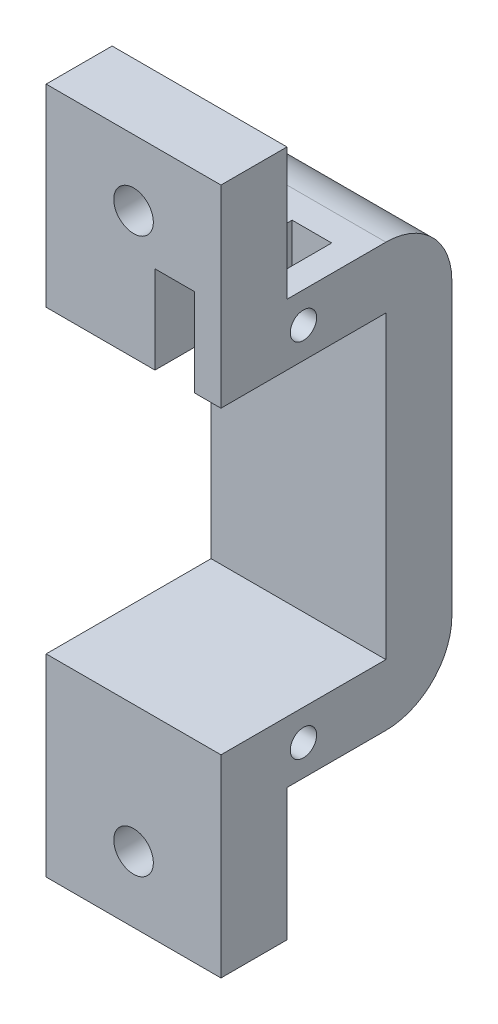
ISO-10303-21;
HEADER;
FILE_DESCRIPTION(('STEP AP214'),'2;1');
FILE_NAME('part.step','',(''),(''),'','','');
FILE_SCHEMA(('AUTOMOTIVE_DESIGN { 1 0 10303 214 1 1 1 1 }'));
ENDSEC;
DATA;
#1=APPLICATION_CONTEXT('core data for automotive mechanical design processes');
#2=APPLICATION_PROTOCOL_DEFINITION('international standard','automotive_design',2000,#1);
#3=PRODUCT_CONTEXT('',#1,'mechanical');
#4=PRODUCT('Part','Part','',(#3));
#5=PRODUCT_RELATED_PRODUCT_CATEGORY('part','',(#4));
#6=PRODUCT_DEFINITION_FORMATION('','',#4);
#7=PRODUCT_DEFINITION_CONTEXT('part definition',#1,'design');
#8=PRODUCT_DEFINITION('design','',#6,#7);
#9=PRODUCT_DEFINITION_SHAPE('','',#8);
#10=(LENGTH_UNIT() NAMED_UNIT(*) SI_UNIT(.MILLI.,.METRE.));
#11=(NAMED_UNIT(*) PLANE_ANGLE_UNIT() SI_UNIT($,.RADIAN.));
#12=(NAMED_UNIT(*) SI_UNIT($,.STERADIAN.) SOLID_ANGLE_UNIT());
#13=UNCERTAINTY_MEASURE_WITH_UNIT(LENGTH_MEASURE(1.E-05),#10,'distance_accuracy_value','');
#14=(GEOMETRIC_REPRESENTATION_CONTEXT(3) GLOBAL_UNCERTAINTY_ASSIGNED_CONTEXT((#13)) GLOBAL_UNIT_ASSIGNED_CONTEXT((#10,
#11,#12)) REPRESENTATION_CONTEXT('',''));
#15=CARTESIAN_POINT('',(0.,0.,0.));
#16=DIRECTION('',(0.,0.,1.));
#17=DIRECTION('',(1.,0.,0.));
#18=AXIS2_PLACEMENT_3D('',#15,#16,#17);
#19=CARTESIAN_POINT('',(-21.7379181981433,-2.325,12.411797698406));
#20=DIRECTION('',(1.,0.,0.));
#21=DIRECTION('',(0.,0.,-1.));
#22=AXIS2_PLACEMENT_3D('',#19,#20,#21);
#23=CYLINDRICAL_SURFACE('',#22,1.);
#24=CARTESIAN_POINT('',(-13.4879181981433,-2.325,12.411797698406));
#25=DIRECTION('',(-1.,0.,0.));
#26=DIRECTION('',(0.,0.,1.));
#27=AXIS2_PLACEMENT_3D('',#24,#25,#26);
#28=CIRCLE('',#27,1.);
#29=CARTESIAN_POINT('',(-13.4879181981433,-2.325,13.411797698406));
#30=VERTEX_POINT('',#29);
#31=EDGE_CURVE('E288',#30,#30,#28,.F.);
#32=ORIENTED_EDGE('',*,*,#31,.T.);
#33=EDGE_LOOP('',(#32));
#34=FACE_BOUND('',#33,.T.);
#35=CARTESIAN_POINT('',(-21.7379181981433,-2.325,12.411797698406));
#36=DIRECTION('',(1.,0.,0.));
#37=DIRECTION('',(0.,0.,-1.));
#38=AXIS2_PLACEMENT_3D('',#35,#36,#37);
#39=CIRCLE('',#38,1.);
#40=CARTESIAN_POINT('',(-21.7379181981433,-2.325,11.411797698406));
#41=VERTEX_POINT('',#40);
#42=EDGE_CURVE('E356',#41,#41,#39,.T.);
#43=ORIENTED_EDGE('',*,*,#42,.F.);
#44=EDGE_LOOP('',(#43));
#45=FACE_BOUND('',#44,.T.);
#46=ADVANCED_FACE('F34',(#34,#45),#23,.F.);
#47=CARTESIAN_POINT('',(-21.7379181981433,-32.05,1.16179769840603));
#48=DIRECTION('',(0.,1.,0.));
#49=DIRECTION('',(-1.,0.,0.));
#50=AXIS2_PLACEMENT_3D('',#47,#48,#49);
#51=PLANE('',#50);
#52=DIRECTION('',(0.,0.,1.));
#53=VECTOR('',#52,1.);
#54=CARTESIAN_POINT('',(-21.7379181981433,-32.05,1.16179769840603));
#55=LINE('',#54,#53);
#56=CARTESIAN_POINT('',(-21.7379181981433,-32.05,6.16179769840603));
#57=VERTEX_POINT('',#56);
#58=CARTESIAN_POINT('',(-21.7379181981433,-32.05,13.661797698406));
#59=VERTEX_POINT('',#58);
#60=EDGE_CURVE('E257',#57,#59,#55,.T.);
#61=ORIENTED_EDGE('',*,*,#60,.F.);
#62=DIRECTION('',(-1.,0.,0.));
#63=VECTOR('',#62,1.);
#64=CARTESIAN_POINT('',(-21.7379181981433,-32.05,6.16179769840603));
#65=LINE('',#64,#63);
#66=CARTESIAN_POINT('',(-8.48791819814331,-32.05,6.16179769840603));
#67=VERTEX_POINT('',#66);
#68=EDGE_CURVE('E42',#57,#67,#65,.F.);
#69=ORIENTED_EDGE('',*,*,#68,.T.);
#70=DIRECTION('',(0.,0.,1.));
#71=VECTOR('',#70,1.);
#72=CARTESIAN_POINT('',(-8.48791819814331,-32.05,1.16179769840603));
#73=LINE('',#72,#71);
#74=CARTESIAN_POINT('',(-8.48791819814331,-32.05,13.661797698406));
#75=VERTEX_POINT('',#74);
#76=EDGE_CURVE('E262',#67,#75,#73,.T.);
#77=ORIENTED_EDGE('',*,*,#76,.T.);
#78=DIRECTION('',(1.,0.,0.));
#79=VECTOR('',#78,1.);
#80=CARTESIAN_POINT('',(-21.7379181981433,-32.05,13.661797698406));
#81=LINE('',#80,#79);
#82=EDGE_CURVE('E216',#59,#75,#81,.T.);
#83=ORIENTED_EDGE('',*,*,#82,.F.);
#84=EDGE_LOOP('',(#61,#69,#77,#83));
#85=FACE_BOUND('',#84,.T.);
#86=ADVANCED_FACE('F325',(#85),#51,.F.);
#87=CARTESIAN_POINT('',(0.,0.,6.16179769840603));
#88=DIRECTION('',(0.,0.,1.));
#89=DIRECTION('',(1.,0.,0.));
#90=AXIS2_PLACEMENT_3D('',#87,#88,#89);
#91=PLANE('',#90);
#92=DIRECTION('',(0.,1.,0.));
#93=VECTOR('',#92,1.);
#94=CARTESIAN_POINT('',(-21.7379181981433,0.,6.16179769840603));
#95=LINE('',#94,#93);
#96=CARTESIAN_POINT('',(-21.7379181981433,-27.4,6.16179769840603));
#97=VERTEX_POINT('',#96);
#98=CARTESIAN_POINT('',(-21.7379181981433,-4.65,6.16179769840603));
#99=VERTEX_POINT('',#98);
#100=EDGE_CURVE('E250',#97,#99,#95,.T.);
#101=ORIENTED_EDGE('',*,*,#100,.F.);
#102=DIRECTION('',(-1.,0.,0.));
#103=VECTOR('',#102,1.);
#104=CARTESIAN_POINT('',(-8.48791819814331,-27.4,6.16179769840603));
#105=LINE('',#104,#103);
#106=CARTESIAN_POINT('',(-8.48791819814331,-27.4,6.16179769840603));
#107=VERTEX_POINT('',#106);
#108=EDGE_CURVE('E236',#107,#97,#105,.T.);
#109=ORIENTED_EDGE('',*,*,#108,.F.);
#110=DIRECTION('',(0.,-1.,0.));
#111=VECTOR('',#110,1.);
#112=CARTESIAN_POINT('',(-8.4879181981433,0.,6.16179769840603));
#113=LINE('',#112,#111);
#114=CARTESIAN_POINT('',(-8.4879181981433,-4.65,6.16179769840603));
#115=VERTEX_POINT('',#114);
#116=EDGE_CURVE('E254',#115,#107,#113,.T.);
#117=ORIENTED_EDGE('',*,*,#116,.F.);
#118=DIRECTION('',(-1.,0.,0.));
#119=VECTOR('',#118,1.);
#120=CARTESIAN_POINT('',(-21.7379181981433,-4.65,6.16179769840603));
#121=LINE('',#120,#119);
#122=EDGE_CURVE('E274',#115,#99,#121,.T.);
#123=ORIENTED_EDGE('',*,*,#122,.T.);
#124=EDGE_LOOP('',(#101,#109,#117,#123));
#125=FACE_BOUND('',#124,.T.);
#126=ADVANCED_FACE('F333',(#125),#91,.T.);
#127=CARTESIAN_POINT('',(-21.7379181981433,-4.65,6.16179769840603));
#128=DIRECTION('',(-1.,0.,0.));
#129=DIRECTION('',(0.,0.,1.));
#130=AXIS2_PLACEMENT_3D('',#127,#128,#129);
#131=PLANE('',#130);
#132=CARTESIAN_POINT('',(-21.7379181981433,-29.725,12.411797698406));
#133=DIRECTION('',(1.,0.,0.));
#134=DIRECTION('',(0.,0.,-1.));
#135=AXIS2_PLACEMENT_3D('',#132,#133,#134);
#136=CIRCLE('',#135,1.);
#137=CARTESIAN_POINT('',(-21.7379181981433,-29.725,11.411797698406));
#138=VERTEX_POINT('',#137);
#139=EDGE_CURVE('E357',#138,#138,#136,.T.);
#140=ORIENTED_EDGE('',*,*,#139,.T.);
#141=EDGE_LOOP('',(#140));
#142=FACE_BOUND('',#141,.T.);
#143=ORIENTED_EDGE('',*,*,#42,.T.);
#144=EDGE_LOOP('',(#143));
#145=FACE_BOUND('',#144,.T.);
#146=DIRECTION('',(0.,1.,0.));
#147=VECTOR('',#146,1.);
#148=CARTESIAN_POINT('',(-21.7379181981433,0.,1.16179769840603));
#149=LINE('',#148,#147);
#150=CARTESIAN_POINT('',(-21.7379181981433,-27.05,1.16179769840603));
#151=VERTEX_POINT('',#150);
#152=CARTESIAN_POINT('',(-21.7379181981433,-5.,1.16179769840603));
#153=VERTEX_POINT('',#152);
#154=EDGE_CURVE('E251',#151,#153,#149,.T.);
#155=ORIENTED_EDGE('',*,*,#154,.F.);
#156=CARTESIAN_POINT('',(-21.7379181981433,-27.05,6.16179769840603));
#157=DIRECTION('',(-1.,0.,0.));
#158=DIRECTION('',(0.,0.,1.));
#159=AXIS2_PLACEMENT_3D('',#156,#157,#158);
#160=CIRCLE('',#159,5.);
#161=EDGE_CURVE('E56',#151,#57,#160,.T.);
#162=ORIENTED_EDGE('',*,*,#161,.T.);
#163=ORIENTED_EDGE('',*,*,#60,.T.);
#164=DIRECTION('',(0.,1.,0.));
#165=VECTOR('',#164,1.);
#166=CARTESIAN_POINT('',(-21.7379181981433,-42.05,13.661797698406));
#167=LINE('',#166,#165);
#168=CARTESIAN_POINT('',(-21.7379181981433,-42.05,13.661797698406));
#169=VERTEX_POINT('',#168);
#170=EDGE_CURVE('E233',#169,#59,#167,.T.);
#171=ORIENTED_EDGE('',*,*,#170,.F.);
#172=DIRECTION('',(0.,0.,-1.));
#173=VECTOR('',#172,1.);
#174=CARTESIAN_POINT('',(-21.7379181981433,-42.05,18.661797698406));
#175=LINE('',#174,#173);
#176=CARTESIAN_POINT('',(-21.7379181981433,-42.05,18.661797698406));
#177=VERTEX_POINT('',#176);
#178=EDGE_CURVE('E217',#177,#169,#175,.T.);
#179=ORIENTED_EDGE('',*,*,#178,.F.);
#180=DIRECTION('',(0.,-1.,0.));
#181=VECTOR('',#180,1.);
#182=CARTESIAN_POINT('',(-21.7379181981433,-32.05,18.661797698406));
#183=LINE('',#182,#181);
#184=CARTESIAN_POINT('',(-21.7379181981433,-27.4,18.661797698406));
#185=VERTEX_POINT('',#184);
#186=EDGE_CURVE('E242',#185,#177,#183,.T.);
#187=ORIENTED_EDGE('',*,*,#186,.F.);
#188=DIRECTION('',(0.,0.,-1.));
#189=VECTOR('',#188,1.);
#190=CARTESIAN_POINT('',(-21.7379181981433,-27.4,18.661797698406));
#191=LINE('',#190,#189);
#192=EDGE_CURVE('E244',#185,#97,#191,.T.);
#193=ORIENTED_EDGE('',*,*,#192,.T.);
#194=ORIENTED_EDGE('',*,*,#100,.T.);
#195=DIRECTION('',(0.,0.,1.));
#196=VECTOR('',#195,1.);
#197=CARTESIAN_POINT('',(-21.7379181981433,-4.65,6.16179769840603));
#198=LINE('',#197,#196);
#199=CARTESIAN_POINT('',(-21.7379181981433,-4.65,18.661797698406));
#200=VERTEX_POINT('',#199);
#201=EDGE_CURVE('E264',#99,#200,#198,.T.);
#202=ORIENTED_EDGE('',*,*,#201,.T.);
#203=DIRECTION('',(0.,1.,0.));
#204=VECTOR('',#203,1.);
#205=CARTESIAN_POINT('',(-21.7379181981433,-4.65,18.661797698406));
#206=LINE('',#205,#204);
#207=CARTESIAN_POINT('',(-21.7379181981433,10.,18.661797698406));
#208=VERTEX_POINT('',#207);
#209=EDGE_CURVE('E277',#200,#208,#206,.T.);
#210=ORIENTED_EDGE('',*,*,#209,.T.);
#211=DIRECTION('',(0.,0.,1.));
#212=VECTOR('',#211,1.);
#213=CARTESIAN_POINT('',(-21.7379181981433,10.,18.661797698406));
#214=LINE('',#213,#212);
#215=CARTESIAN_POINT('',(-21.7379181981433,10.,13.661797698406));
#216=VERTEX_POINT('',#215);
#217=EDGE_CURVE('E203',#216,#208,#214,.T.);
#218=ORIENTED_EDGE('',*,*,#217,.F.);
#219=DIRECTION('',(0.,-1.,0.));
#220=VECTOR('',#219,1.);
#221=CARTESIAN_POINT('',(-21.7379181981433,10.,13.661797698406));
#222=LINE('',#221,#220);
#223=CARTESIAN_POINT('',(-21.7379181981433,0.,13.661797698406));
#224=VERTEX_POINT('',#223);
#225=EDGE_CURVE('E211',#216,#224,#222,.T.);
#226=ORIENTED_EDGE('',*,*,#225,.T.);
#227=DIRECTION('',(0.,0.,1.));
#228=VECTOR('',#227,1.);
#229=CARTESIAN_POINT('',(-21.7379181981433,0.,6.16179769840603));
#230=LINE('',#229,#228);
#231=CARTESIAN_POINT('',(-21.7379181981433,0.,6.16179769840603));
#232=VERTEX_POINT('',#231);
#233=EDGE_CURVE('E199',#232,#224,#230,.T.);
#234=ORIENTED_EDGE('',*,*,#233,.F.);
#235=CARTESIAN_POINT('',(-21.7379181981433,-5.,6.16179769840603));
#236=DIRECTION('',(-1.,0.,0.));
#237=DIRECTION('',(0.,0.,1.));
#238=AXIS2_PLACEMENT_3D('',#235,#236,#237);
#239=CIRCLE('',#238,5.);
#240=EDGE_CURVE('E298',#232,#153,#239,.T.);
#241=ORIENTED_EDGE('',*,*,#240,.T.);
#242=EDGE_LOOP('',(#155,#162,#163,#171,#179,#187,#193,#194,#202,#210,#218,#226,#234,#241));
#243=FACE_BOUND('',#242,.T.);
#244=ADVANCED_FACE('F310',(#142,#145,#243),#131,.T.);
#245=CARTESIAN_POINT('',(-8.4879181981433,-4.65,6.16179769840603));
#246=DIRECTION('',(1.,0.,0.));
#247=DIRECTION('',(0.,0.,-1.));
#248=AXIS2_PLACEMENT_3D('',#245,#246,#247);
#249=PLANE('',#248);
#250=CARTESIAN_POINT('',(-8.4879181981433,-29.725,12.411797698406));
#251=DIRECTION('',(1.,0.,0.));
#252=DIRECTION('',(0.,0.,-1.));
#253=AXIS2_PLACEMENT_3D('',#250,#251,#252);
#254=CIRCLE('',#253,1.);
#255=CARTESIAN_POINT('',(-8.4879181981433,-29.725,11.411797698406));
#256=VERTEX_POINT('',#255);
#257=EDGE_CURVE('E363',#256,#256,#254,.T.);
#258=ORIENTED_EDGE('',*,*,#257,.F.);
#259=EDGE_LOOP('',(#258));
#260=FACE_BOUND('',#259,.T.);
#261=CARTESIAN_POINT('',(-8.4879181981433,-2.325,12.411797698406));
#262=DIRECTION('',(1.,0.,0.));
#263=DIRECTION('',(0.,0.,-1.));
#264=AXIS2_PLACEMENT_3D('',#261,#262,#263);
#265=CIRCLE('',#264,1.);
#266=CARTESIAN_POINT('',(-8.4879181981433,-2.325,11.411797698406));
#267=VERTEX_POINT('',#266);
#268=EDGE_CURVE('E354',#267,#267,#265,.T.);
#269=ORIENTED_EDGE('',*,*,#268,.F.);
#270=EDGE_LOOP('',(#269));
#271=FACE_BOUND('',#270,.T.);
#272=ORIENTED_EDGE('',*,*,#76,.F.);
#273=CARTESIAN_POINT('',(-8.4879181981433,-27.05,6.16179769840603));
#274=DIRECTION('',(1.,0.,0.));
#275=DIRECTION('',(0.,0.,-1.));
#276=AXIS2_PLACEMENT_3D('',#273,#274,#275);
#277=CIRCLE('',#276,5.);
#278=CARTESIAN_POINT('',(-8.48791819814331,-27.05,1.16179769840603));
#279=VERTEX_POINT('',#278);
#280=EDGE_CURVE('E11',#67,#279,#277,.T.);
#281=ORIENTED_EDGE('',*,*,#280,.T.);
#282=DIRECTION('',(0.,-1.,0.));
#283=VECTOR('',#282,1.);
#284=CARTESIAN_POINT('',(-8.4879181981433,0.,1.16179769840603));
#285=LINE('',#284,#283);
#286=CARTESIAN_POINT('',(-8.4879181981433,-5.,1.16179769840603));
#287=VERTEX_POINT('',#286);
#288=EDGE_CURVE('E253',#287,#279,#285,.T.);
#289=ORIENTED_EDGE('',*,*,#288,.F.);
#290=CARTESIAN_POINT('',(-8.4879181981433,-5.,6.16179769840603));
#291=DIRECTION('',(1.,0.,0.));
#292=DIRECTION('',(0.,0.,-1.));
#293=AXIS2_PLACEMENT_3D('',#290,#291,#292);
#294=CIRCLE('',#293,5.);
#295=CARTESIAN_POINT('',(-8.4879181981433,0.,6.16179769840603));
#296=VERTEX_POINT('',#295);
#297=EDGE_CURVE('E294',#287,#296,#294,.T.);
#298=ORIENTED_EDGE('',*,*,#297,.T.);
#299=DIRECTION('',(0.,0.,-1.));
#300=VECTOR('',#299,1.);
#301=CARTESIAN_POINT('',(-8.4879181981433,0.,6.16179769840603));
#302=LINE('',#301,#300);
#303=CARTESIAN_POINT('',(-8.4879181981433,0.,13.661797698406));
#304=VERTEX_POINT('',#303);
#305=EDGE_CURVE('E268',#304,#296,#302,.T.);
#306=ORIENTED_EDGE('',*,*,#305,.F.);
#307=DIRECTION('',(0.,-1.,0.));
#308=VECTOR('',#307,1.);
#309=CARTESIAN_POINT('',(-8.4879181981433,10.,13.661797698406));
#310=LINE('',#309,#308);
#311=CARTESIAN_POINT('',(-8.4879181981433,10.,13.661797698406));
#312=VERTEX_POINT('',#311);
#313=EDGE_CURVE('E213',#312,#304,#310,.T.);
#314=ORIENTED_EDGE('',*,*,#313,.F.);
#315=DIRECTION('',(0.,0.,-1.));
#316=VECTOR('',#315,1.);
#317=CARTESIAN_POINT('',(-8.4879181981433,10.,18.661797698406));
#318=LINE('',#317,#316);
#319=CARTESIAN_POINT('',(-8.4879181981433,10.,18.661797698406));
#320=VERTEX_POINT('',#319);
#321=EDGE_CURVE('E378',#320,#312,#318,.T.);
#322=ORIENTED_EDGE('',*,*,#321,.F.);
#323=DIRECTION('',(0.,1.,0.));
#324=VECTOR('',#323,1.);
#325=CARTESIAN_POINT('',(-8.4879181981433,-4.65,18.661797698406));
#326=LINE('',#325,#324);
#327=CARTESIAN_POINT('',(-8.4879181981433,-4.65,18.661797698406));
#328=VERTEX_POINT('',#327);
#329=EDGE_CURVE('E280',#328,#320,#326,.T.);
#330=ORIENTED_EDGE('',*,*,#329,.F.);
#331=DIRECTION('',(0.,0.,-1.));
#332=VECTOR('',#331,1.);
#333=CARTESIAN_POINT('',(-8.4879181981433,-4.65,6.16179769840603));
#334=LINE('',#333,#332);
#335=EDGE_CURVE('E272',#328,#115,#334,.T.);
#336=ORIENTED_EDGE('',*,*,#335,.T.);
#337=ORIENTED_EDGE('',*,*,#116,.T.);
#338=DIRECTION('',(0.,0.,-1.));
#339=VECTOR('',#338,1.);
#340=CARTESIAN_POINT('',(-8.48791819814331,-27.4,18.661797698406));
#341=LINE('',#340,#339);
#342=CARTESIAN_POINT('',(-8.48791819814331,-27.4,18.661797698406));
#343=VERTEX_POINT('',#342);
#344=EDGE_CURVE('E248',#343,#107,#341,.T.);
#345=ORIENTED_EDGE('',*,*,#344,.F.);
#346=DIRECTION('',(0.,1.,0.));
#347=VECTOR('',#346,1.);
#348=CARTESIAN_POINT('',(-8.48791819814331,-32.05,18.661797698406));
#349=LINE('',#348,#347);
#350=CARTESIAN_POINT('',(-8.48791819814331,-42.05,18.661797698406));
#351=VERTEX_POINT('',#350);
#352=EDGE_CURVE('E237',#351,#343,#349,.T.);
#353=ORIENTED_EDGE('',*,*,#352,.F.);
#354=DIRECTION('',(0.,0.,1.));
#355=VECTOR('',#354,1.);
#356=CARTESIAN_POINT('',(-8.48791819814331,-42.05,18.661797698406));
#357=LINE('',#356,#355);
#358=CARTESIAN_POINT('',(-8.48791819814331,-42.05,13.661797698406));
#359=VERTEX_POINT('',#358);
#360=EDGE_CURVE('E222',#359,#351,#357,.T.);
#361=ORIENTED_EDGE('',*,*,#360,.F.);
#362=DIRECTION('',(0.,1.,0.));
#363=VECTOR('',#362,1.);
#364=CARTESIAN_POINT('',(-8.48791819814331,-42.05,13.661797698406));
#365=LINE('',#364,#363);
#366=EDGE_CURVE('E228',#359,#75,#365,.T.);
#367=ORIENTED_EDGE('',*,*,#366,.T.);
#368=EDGE_LOOP('',(#272,#281,#289,#298,#306,#314,#322,#330,#336,#337,#345,#353,#361,#367));
#369=FACE_BOUND('',#368,.T.);
#370=ADVANCED_FACE('F317',(#260,#271,#369),#249,.T.);
#371=CARTESIAN_POINT('',(-21.7379181981433,-4.65,18.661797698406));
#372=DIRECTION('',(0.,0.,1.));
#373=DIRECTION('',(1.,0.,0.));
#374=AXIS2_PLACEMENT_3D('',#371,#372,#373);
#375=PLANE('',#374);
#376=DIRECTION('',(-1.,0.,0.));
#377=VECTOR('',#376,1.);
#378=CARTESIAN_POINT('',(-21.7379181981433,2.,18.661797698406));
#379=LINE('',#378,#377);
#380=CARTESIAN_POINT('',(-10.4879181981433,2.,18.661797698406));
#381=VERTEX_POINT('',#380);
#382=CARTESIAN_POINT('',(-13.4879181981433,2.,18.661797698406));
#383=VERTEX_POINT('',#382);
#384=EDGE_CURVE('E194',#381,#383,#379,.T.);
#385=ORIENTED_EDGE('',*,*,#384,.F.);
#386=DIRECTION('',(0.,1.,0.));
#387=VECTOR('',#386,1.);
#388=CARTESIAN_POINT('',(-10.4879181981433,-10.,18.661797698406));
#389=LINE('',#388,#387);
#390=CARTESIAN_POINT('',(-10.4879181981433,-4.65,18.661797698406));
#391=VERTEX_POINT('',#390);
#392=EDGE_CURVE('E406',#391,#381,#389,.T.);
#393=ORIENTED_EDGE('',*,*,#392,.F.);
#394=DIRECTION('',(1.,0.,0.));
#395=VECTOR('',#394,1.);
#396=CARTESIAN_POINT('',(-21.7379181981433,-4.65,18.661797698406));
#397=LINE('',#396,#395);
#398=EDGE_CURVE('E267',#391,#328,#397,.T.);
#399=ORIENTED_EDGE('',*,*,#398,.T.);
#400=ORIENTED_EDGE('',*,*,#329,.T.);
#401=DIRECTION('',(1.,0.,0.));
#402=VECTOR('',#401,1.);
#403=CARTESIAN_POINT('',(-21.7379181981433,10.,18.661797698406));
#404=LINE('',#403,#402);
#405=EDGE_CURVE('E376',#208,#320,#404,.T.);
#406=ORIENTED_EDGE('',*,*,#405,.F.);
#407=ORIENTED_EDGE('',*,*,#209,.F.);
#408=CARTESIAN_POINT('',(-13.4879181981433,-4.65,18.661797698406));
#409=VERTEX_POINT('',#408);
#410=EDGE_CURVE('E269',#200,#409,#397,.T.);
#411=ORIENTED_EDGE('',*,*,#410,.T.);
#412=DIRECTION('',(0.,1.,0.));
#413=VECTOR('',#412,1.);
#414=CARTESIAN_POINT('',(-13.4879181981433,-10.,18.661797698406));
#415=LINE('',#414,#413);
#416=EDGE_CURVE('E399',#409,#383,#415,.T.);
#417=ORIENTED_EDGE('',*,*,#416,.T.);
#418=EDGE_LOOP('',(#385,#393,#399,#400,#406,#407,#411,#417));
#419=FACE_BOUND('',#418,.T.);
#420=CARTESIAN_POINT('',(-15.1129181981433,5.,18.661797698406));
#421=DIRECTION('',(0.,0.,1.));
#422=DIRECTION('',(1.,0.,0.));
#423=AXIS2_PLACEMENT_3D('',#420,#421,#422);
#424=CIRCLE('',#423,1.5);
#425=CARTESIAN_POINT('',(-13.6129181981433,5.,18.661797698406));
#426=VERTEX_POINT('',#425);
#427=EDGE_CURVE('E201',#426,#426,#424,.T.);
#428=ORIENTED_EDGE('',*,*,#427,.F.);
#429=EDGE_LOOP('',(#428));
#430=FACE_BOUND('',#429,.T.);
#431=ADVANCED_FACE('F390',(#419,#430),#375,.T.);
#432=CARTESIAN_POINT('',(0.,-4.65,0.));
#433=DIRECTION('',(0.,1.,0.));
#434=DIRECTION('',(0.,0.,1.));
#435=AXIS2_PLACEMENT_3D('',#432,#433,#434);
#436=PLANE('',#435);
#437=DIRECTION('',(-1.,0.,0.));
#438=VECTOR('',#437,1.);
#439=CARTESIAN_POINT('',(0.,-4.65,8.27082062568252));
#440=LINE('',#439,#438);
#441=CARTESIAN_POINT('',(-10.4879181981433,-4.65,8.27082062568252));
#442=VERTEX_POINT('',#441);
#443=CARTESIAN_POINT('',(-13.4879181981433,-4.65,8.27082062568252));
#444=VERTEX_POINT('',#443);
#445=EDGE_CURVE('E413',#442,#444,#440,.T.);
#446=ORIENTED_EDGE('',*,*,#445,.T.);
#447=DIRECTION('',(0.,0.,1.));
#448=VECTOR('',#447,1.);
#449=CARTESIAN_POINT('',(-13.4879181981433,-4.65,0.));
#450=LINE('',#449,#448);
#451=EDGE_CURVE('E291',#444,#409,#450,.T.);
#452=ORIENTED_EDGE('',*,*,#451,.T.);
#453=ORIENTED_EDGE('',*,*,#410,.F.);
#454=ORIENTED_EDGE('',*,*,#201,.F.);
#455=ORIENTED_EDGE('',*,*,#122,.F.);
#456=ORIENTED_EDGE('',*,*,#335,.F.);
#457=ORIENTED_EDGE('',*,*,#398,.F.);
#458=DIRECTION('',(0.,0.,-1.));
#459=VECTOR('',#458,1.);
#460=CARTESIAN_POINT('',(-10.4879181981433,-4.65,0.));
#461=LINE('',#460,#459);
#462=EDGE_CURVE('E287',#391,#442,#461,.T.);
#463=ORIENTED_EDGE('',*,*,#462,.T.);
#464=EDGE_LOOP('',(#446,#452,#453,#454,#455,#456,#457,#463));
#465=FACE_BOUND('',#464,.T.);
#466=ADVANCED_FACE('F426',(#465),#436,.F.);
#467=CARTESIAN_POINT('',(0.,0.,0.));
#468=DIRECTION('',(0.,1.,0.));
#469=DIRECTION('',(0.,0.,1.));
#470=AXIS2_PLACEMENT_3D('',#467,#468,#469);
#471=PLANE('',#470);
#472=ORIENTED_EDGE('',*,*,#305,.T.);
#473=DIRECTION('',(1.,0.,0.));
#474=VECTOR('',#473,1.);
#475=CARTESIAN_POINT('',(-21.7379181981433,0.,6.16179769840603));
#476=LINE('',#475,#474);
#477=EDGE_CURVE('E296',#296,#232,#476,.F.);
#478=ORIENTED_EDGE('',*,*,#477,.T.);
#479=ORIENTED_EDGE('',*,*,#233,.T.);
#480=DIRECTION('',(-1.,0.,0.));
#481=VECTOR('',#480,1.);
#482=CARTESIAN_POINT('',(-21.7379181981433,0.,13.661797698406));
#483=LINE('',#482,#481);
#484=CARTESIAN_POINT('',(-13.4879181981433,0.,13.661797698406));
#485=VERTEX_POINT('',#484);
#486=EDGE_CURVE('E176',#485,#224,#483,.T.);
#487=ORIENTED_EDGE('',*,*,#486,.F.);
#488=DIRECTION('',(0.,0.,1.));
#489=VECTOR('',#488,1.);
#490=CARTESIAN_POINT('',(-13.4879181981433,0.,18.661797698406));
#491=LINE('',#490,#489);
#492=CARTESIAN_POINT('',(-13.4879181981433,0.,8.27082062568252));
#493=VERTEX_POINT('',#492);
#494=EDGE_CURVE('E186',#493,#485,#491,.T.);
#495=ORIENTED_EDGE('',*,*,#494,.F.);
#496=DIRECTION('',(-1.,0.,0.));
#497=VECTOR('',#496,1.);
#498=CARTESIAN_POINT('',(-13.4879181981433,0.,8.27082062568252));
#499=LINE('',#498,#497);
#500=CARTESIAN_POINT('',(-10.4879181981433,0.,8.27082062568252));
#501=VERTEX_POINT('',#500);
#502=EDGE_CURVE('E396',#501,#493,#499,.T.);
#503=ORIENTED_EDGE('',*,*,#502,.F.);
#504=DIRECTION('',(0.,0.,-1.));
#505=VECTOR('',#504,1.);
#506=CARTESIAN_POINT('',(-10.4879181981433,0.,18.661797698406));
#507=LINE('',#506,#505);
#508=CARTESIAN_POINT('',(-10.4879181981433,0.,13.661797698406));
#509=VERTEX_POINT('',#508);
#510=EDGE_CURVE('E193',#509,#501,#507,.T.);
#511=ORIENTED_EDGE('',*,*,#510,.F.);
#512=EDGE_CURVE('E200',#304,#509,#483,.T.);
#513=ORIENTED_EDGE('',*,*,#512,.F.);
#514=EDGE_LOOP('',(#472,#478,#479,#487,#495,#503,#511,#513));
#515=FACE_BOUND('',#514,.T.);
#516=ADVANCED_FACE('F197',(#515),#471,.T.);
#517=CARTESIAN_POINT('',(0.,0.,1.16179769840603));
#518=DIRECTION('',(0.,0.,1.));
#519=DIRECTION('',(1.,0.,0.));
#520=AXIS2_PLACEMENT_3D('',#517,#518,#519);
#521=PLANE('',#520);
#522=ORIENTED_EDGE('',*,*,#288,.T.);
#523=DIRECTION('',(-1.,0.,0.));
#524=VECTOR('',#523,1.);
#525=CARTESIAN_POINT('',(0.,-27.05,1.16179769840603));
#526=LINE('',#525,#524);
#527=EDGE_CURVE('E301',#279,#151,#526,.T.);
#528=ORIENTED_EDGE('',*,*,#527,.T.);
#529=ORIENTED_EDGE('',*,*,#154,.T.);
#530=DIRECTION('',(1.,0.,0.));
#531=VECTOR('',#530,1.);
#532=CARTESIAN_POINT('',(-8.4879181981433,-5.,1.16179769840603));
#533=LINE('',#532,#531);
#534=EDGE_CURVE('E282',#153,#287,#533,.T.);
#535=ORIENTED_EDGE('',*,*,#534,.T.);
#536=EDGE_LOOP('',(#522,#528,#529,#535));
#537=FACE_BOUND('',#536,.T.);
#538=ADVANCED_FACE('F306',(#537),#521,.F.);
#539=CARTESIAN_POINT('',(-8.48791819814331,-27.4,18.661797698406));
#540=DIRECTION('',(0.,-1.,0.));
#541=DIRECTION('',(1.,0.,0.));
#542=AXIS2_PLACEMENT_3D('',#539,#540,#541);
#543=PLANE('',#542);
#544=ORIENTED_EDGE('',*,*,#108,.T.);
#545=ORIENTED_EDGE('',*,*,#192,.F.);
#546=DIRECTION('',(-1.,0.,0.));
#547=VECTOR('',#546,1.);
#548=CARTESIAN_POINT('',(-8.48791819814331,-27.4,18.661797698406));
#549=LINE('',#548,#547);
#550=EDGE_CURVE('E240',#343,#185,#549,.T.);
#551=ORIENTED_EDGE('',*,*,#550,.F.);
#552=ORIENTED_EDGE('',*,*,#344,.T.);
#553=EDGE_LOOP('',(#544,#545,#551,#552));
#554=FACE_BOUND('',#553,.T.);
#555=ADVANCED_FACE('F440',(#554),#543,.F.);
#556=CARTESIAN_POINT('',(0.,0.,18.661797698406));
#557=DIRECTION('',(0.,0.,1.));
#558=DIRECTION('',(1.,0.,0.));
#559=AXIS2_PLACEMENT_3D('',#556,#557,#558);
#560=PLANE('',#559);
#561=CARTESIAN_POINT('',(-15.1129181981433,-37.05,18.661797698406));
#562=DIRECTION('',(0.,0.,1.));
#563=DIRECTION('',(1.,0.,0.));
#564=AXIS2_PLACEMENT_3D('',#561,#562,#563);
#565=CIRCLE('',#564,1.5);
#566=CARTESIAN_POINT('',(-13.6129181981433,-37.05,18.661797698406));
#567=VERTEX_POINT('',#566);
#568=EDGE_CURVE('E369',#567,#567,#565,.T.);
#569=ORIENTED_EDGE('',*,*,#568,.F.);
#570=EDGE_LOOP('',(#569));
#571=FACE_BOUND('',#570,.T.);
#572=ORIENTED_EDGE('',*,*,#352,.T.);
#573=ORIENTED_EDGE('',*,*,#550,.T.);
#574=ORIENTED_EDGE('',*,*,#186,.T.);
#575=DIRECTION('',(-1.,0.,0.));
#576=VECTOR('',#575,1.);
#577=CARTESIAN_POINT('',(-21.7379181981433,-42.05,18.661797698406));
#578=LINE('',#577,#576);
#579=EDGE_CURVE('E225',#351,#177,#578,.T.);
#580=ORIENTED_EDGE('',*,*,#579,.F.);
#581=EDGE_LOOP('',(#572,#573,#574,#580));
#582=FACE_BOUND('',#581,.T.);
#583=ADVANCED_FACE('F443',(#571,#582),#560,.T.);
#584=CARTESIAN_POINT('',(-21.7379181981433,-42.05,13.661797698406));
#585=DIRECTION('',(0.,0.,1.));
#586=DIRECTION('',(1.,0.,0.));
#587=AXIS2_PLACEMENT_3D('',#584,#585,#586);
#588=PLANE('',#587);
#589=CARTESIAN_POINT('',(-15.1129181981433,-37.05,13.661797698406));
#590=DIRECTION('',(0.,0.,-1.));
#591=DIRECTION('',(-1.,0.,0.));
#592=AXIS2_PLACEMENT_3D('',#589,#590,#591);
#593=CIRCLE('',#592,1.5);
#594=CARTESIAN_POINT('',(-16.6129181981433,-37.05,13.661797698406));
#595=VERTEX_POINT('',#594);
#596=EDGE_CURVE('E360',#595,#595,#593,.T.);
#597=ORIENTED_EDGE('',*,*,#596,.F.);
#598=EDGE_LOOP('',(#597));
#599=FACE_BOUND('',#598,.T.);
#600=ORIENTED_EDGE('',*,*,#82,.T.);
#601=ORIENTED_EDGE('',*,*,#366,.F.);
#602=DIRECTION('',(1.,0.,0.));
#603=VECTOR('',#602,1.);
#604=CARTESIAN_POINT('',(-21.7379181981433,-42.05,13.661797698406));
#605=LINE('',#604,#603);
#606=EDGE_CURVE('E220',#169,#359,#605,.T.);
#607=ORIENTED_EDGE('',*,*,#606,.F.);
#608=ORIENTED_EDGE('',*,*,#170,.T.);
#609=EDGE_LOOP('',(#600,#601,#607,#608));
#610=FACE_BOUND('',#609,.T.);
#611=ADVANCED_FACE('F447',(#599,#610),#588,.F.);
#612=CARTESIAN_POINT('',(0.,-42.05,0.));
#613=DIRECTION('',(0.,-1.,0.));
#614=DIRECTION('',(1.,0.,0.));
#615=AXIS2_PLACEMENT_3D('',#612,#613,#614);
#616=PLANE('',#615);
#617=ORIENTED_EDGE('',*,*,#178,.T.);
#618=ORIENTED_EDGE('',*,*,#606,.T.);
#619=ORIENTED_EDGE('',*,*,#360,.T.);
#620=ORIENTED_EDGE('',*,*,#579,.T.);
#621=EDGE_LOOP('',(#617,#618,#619,#620));
#622=FACE_BOUND('',#621,.T.);
#623=ADVANCED_FACE('F451',(#622),#616,.T.);
#624=CARTESIAN_POINT('',(-21.7379181981433,10.,13.661797698406));
#625=DIRECTION('',(0.,0.,1.));
#626=DIRECTION('',(1.,0.,0.));
#627=AXIS2_PLACEMENT_3D('',#624,#625,#626);
#628=PLANE('',#627);
#629=CARTESIAN_POINT('',(-15.1129181981433,5.,13.661797698406));
#630=DIRECTION('',(0.,0.,-1.));
#631=DIRECTION('',(-1.,0.,0.));
#632=AXIS2_PLACEMENT_3D('',#629,#630,#631);
#633=CIRCLE('',#632,1.5);
#634=CARTESIAN_POINT('',(-16.6129181981433,5.,13.661797698406));
#635=VERTEX_POINT('',#634);
#636=EDGE_CURVE('E205',#635,#635,#633,.T.);
#637=ORIENTED_EDGE('',*,*,#636,.F.);
#638=EDGE_LOOP('',(#637));
#639=FACE_BOUND('',#638,.T.);
#640=ORIENTED_EDGE('',*,*,#512,.T.);
#641=DIRECTION('',(0.,-1.,0.));
#642=VECTOR('',#641,1.);
#643=CARTESIAN_POINT('',(-10.4879181981433,0.,13.661797698406));
#644=LINE('',#643,#642);
#645=CARTESIAN_POINT('',(-10.4879181981433,2.,13.661797698406));
#646=VERTEX_POINT('',#645);
#647=EDGE_CURVE('E183',#646,#509,#644,.T.);
#648=ORIENTED_EDGE('',*,*,#647,.F.);
#649=DIRECTION('',(1.,0.,0.));
#650=VECTOR('',#649,1.);
#651=CARTESIAN_POINT('',(-10.4879181981433,2.,13.661797698406));
#652=LINE('',#651,#650);
#653=CARTESIAN_POINT('',(-13.4879181981433,2.,13.661797698406));
#654=VERTEX_POINT('',#653);
#655=EDGE_CURVE('E180',#654,#646,#652,.T.);
#656=ORIENTED_EDGE('',*,*,#655,.F.);
#657=DIRECTION('',(0.,1.,0.));
#658=VECTOR('',#657,1.);
#659=CARTESIAN_POINT('',(-13.4879181981433,0.,13.661797698406));
#660=LINE('',#659,#658);
#661=EDGE_CURVE('E170',#485,#654,#660,.T.);
#662=ORIENTED_EDGE('',*,*,#661,.F.);
#663=ORIENTED_EDGE('',*,*,#486,.T.);
#664=ORIENTED_EDGE('',*,*,#225,.F.);
#665=DIRECTION('',(-1.,0.,0.));
#666=VECTOR('',#665,1.);
#667=CARTESIAN_POINT('',(-21.7379181981433,10.,13.661797698406));
#668=LINE('',#667,#666);
#669=EDGE_CURVE('E209',#312,#216,#668,.T.);
#670=ORIENTED_EDGE('',*,*,#669,.F.);
#671=ORIENTED_EDGE('',*,*,#313,.T.);
#672=EDGE_LOOP('',(#640,#648,#656,#662,#663,#664,#670,#671));
#673=FACE_BOUND('',#672,.T.);
#674=ADVANCED_FACE('F173',(#639,#673),#628,.F.);
#675=CARTESIAN_POINT('',(0.,10.,0.));
#676=DIRECTION('',(0.,-1.,0.));
#677=DIRECTION('',(0.,0.,-1.));
#678=AXIS2_PLACEMENT_3D('',#675,#676,#677);
#679=PLANE('',#678);
#680=ORIENTED_EDGE('',*,*,#217,.T.);
#681=ORIENTED_EDGE('',*,*,#405,.T.);
#682=ORIENTED_EDGE('',*,*,#321,.T.);
#683=ORIENTED_EDGE('',*,*,#669,.T.);
#684=EDGE_LOOP('',(#680,#681,#682,#683));
#685=FACE_BOUND('',#684,.T.);
#686=ADVANCED_FACE('F383',(#685),#679,.F.);
#687=CARTESIAN_POINT('',(-15.1129181981433,5.,23.661797698406));
#688=DIRECTION('',(0.,0.,-1.));
#689=DIRECTION('',(-1.,0.,0.));
#690=AXIS2_PLACEMENT_3D('',#687,#688,#689);
#691=CYLINDRICAL_SURFACE('',#690,1.5);
#692=ORIENTED_EDGE('',*,*,#427,.T.);
#693=EDGE_LOOP('',(#692));
#694=FACE_BOUND('',#693,.T.);
#695=ORIENTED_EDGE('',*,*,#636,.T.);
#696=EDGE_LOOP('',(#695));
#697=FACE_BOUND('',#696,.T.);
#698=ADVANCED_FACE('F348',(#694,#697),#691,.F.);
#699=CARTESIAN_POINT('',(-15.1129181981433,-37.05,23.661797698406));
#700=DIRECTION('',(0.,0.,-1.));
#701=DIRECTION('',(-1.,0.,0.));
#702=AXIS2_PLACEMENT_3D('',#699,#700,#701);
#703=CYLINDRICAL_SURFACE('',#702,1.5);
#704=ORIENTED_EDGE('',*,*,#568,.T.);
#705=EDGE_LOOP('',(#704));
#706=FACE_BOUND('',#705,.T.);
#707=ORIENTED_EDGE('',*,*,#596,.T.);
#708=EDGE_LOOP('',(#707));
#709=FACE_BOUND('',#708,.T.);
#710=ADVANCED_FACE('F340',(#706,#709),#703,.F.);
#711=CARTESIAN_POINT('',(-10.4879181981433,-2.325,12.411797698406));
#712=DIRECTION('',(1.,0.,0.));
#713=DIRECTION('',(0.,0.,-1.));
#714=AXIS2_PLACEMENT_3D('',#711,#712,#713);
#715=CIRCLE('',#714,1.);
#716=CARTESIAN_POINT('',(-10.4879181981433,-2.325,11.411797698406));
#717=VERTEX_POINT('',#716);
#718=EDGE_CURVE('E284',#717,#717,#715,.F.);
#719=ORIENTED_EDGE('',*,*,#718,.T.);
#720=EDGE_LOOP('',(#719));
#721=FACE_BOUND('',#720,.T.);
#722=ORIENTED_EDGE('',*,*,#268,.T.);
#723=EDGE_LOOP('',(#722));
#724=FACE_BOUND('',#723,.T.);
#725=ADVANCED_FACE('F328',(#721,#724),#23,.F.);
#726=CARTESIAN_POINT('',(-21.7379181981433,-29.725,12.411797698406));
#727=DIRECTION('',(1.,0.,0.));
#728=DIRECTION('',(0.,0.,-1.));
#729=AXIS2_PLACEMENT_3D('',#726,#727,#728);
#730=CYLINDRICAL_SURFACE('',#729,1.);
#731=ORIENTED_EDGE('',*,*,#139,.F.);
#732=EDGE_LOOP('',(#731));
#733=FACE_BOUND('',#732,.T.);
#734=ORIENTED_EDGE('',*,*,#257,.T.);
#735=EDGE_LOOP('',(#734));
#736=FACE_BOUND('',#735,.T.);
#737=ADVANCED_FACE('F339',(#733,#736),#730,.F.);
#738=CARTESIAN_POINT('',(-13.4879181981433,-10.,8.27082062568252));
#739=DIRECTION('',(0.,0.,-1.));
#740=DIRECTION('',(-1.,0.,0.));
#741=AXIS2_PLACEMENT_3D('',#738,#739,#740);
#742=PLANE('',#741);
#743=DIRECTION('',(0.,1.,0.));
#744=VECTOR('',#743,1.);
#745=CARTESIAN_POINT('',(-10.4879181981433,-10.,8.27082062568252));
#746=LINE('',#745,#744);
#747=EDGE_CURVE('E404',#442,#501,#746,.T.);
#748=ORIENTED_EDGE('',*,*,#747,.T.);
#749=ORIENTED_EDGE('',*,*,#502,.T.);
#750=DIRECTION('',(0.,1.,0.));
#751=VECTOR('',#750,1.);
#752=CARTESIAN_POINT('',(-13.4879181981433,-10.,8.27082062568252));
#753=LINE('',#752,#751);
#754=EDGE_CURVE('E189',#444,#493,#753,.T.);
#755=ORIENTED_EDGE('',*,*,#754,.F.);
#756=ORIENTED_EDGE('',*,*,#445,.F.);
#757=EDGE_LOOP('',(#748,#749,#755,#756));
#758=FACE_BOUND('',#757,.T.);
#759=ADVANCED_FACE('F346',(#758),#742,.F.);
#760=CARTESIAN_POINT('',(-13.4879181981433,-10.,18.661797698406));
#761=DIRECTION('',(-1.,0.,0.));
#762=DIRECTION('',(0.,0.,1.));
#763=AXIS2_PLACEMENT_3D('',#760,#761,#762);
#764=PLANE('',#763);
#765=ORIENTED_EDGE('',*,*,#31,.F.);
#766=EDGE_LOOP('',(#765));
#767=FACE_BOUND('',#766,.T.);
#768=ORIENTED_EDGE('',*,*,#754,.T.);
#769=ORIENTED_EDGE('',*,*,#494,.T.);
#770=ORIENTED_EDGE('',*,*,#661,.T.);
#771=DIRECTION('',(0.,0.,-1.));
#772=VECTOR('',#771,1.);
#773=CARTESIAN_POINT('',(-13.4879181981433,2.,23.661797698406));
#774=LINE('',#773,#772);
#775=EDGE_CURVE('E660',#383,#654,#774,.T.);
#776=ORIENTED_EDGE('',*,*,#775,.F.);
#777=ORIENTED_EDGE('',*,*,#416,.F.);
#778=ORIENTED_EDGE('',*,*,#451,.F.);
#779=EDGE_LOOP('',(#768,#769,#770,#776,#777,#778));
#780=FACE_BOUND('',#779,.T.);
#781=ADVANCED_FACE('F187',(#767,#780),#764,.F.);
#782=CARTESIAN_POINT('',(-10.4879181981433,-10.,18.661797698406));
#783=DIRECTION('',(1.,0.,0.));
#784=DIRECTION('',(0.,0.,-1.));
#785=AXIS2_PLACEMENT_3D('',#782,#783,#784);
#786=PLANE('',#785);
#787=ORIENTED_EDGE('',*,*,#718,.F.);
#788=EDGE_LOOP('',(#787));
#789=FACE_BOUND('',#788,.T.);
#790=ORIENTED_EDGE('',*,*,#392,.T.);
#791=DIRECTION('',(0.,0.,-1.));
#792=VECTOR('',#791,1.);
#793=CARTESIAN_POINT('',(-10.4879181981433,2.,23.661797698406));
#794=LINE('',#793,#792);
#795=EDGE_CURVE('E661',#381,#646,#794,.T.);
#796=ORIENTED_EDGE('',*,*,#795,.T.);
#797=ORIENTED_EDGE('',*,*,#647,.T.);
#798=ORIENTED_EDGE('',*,*,#510,.T.);
#799=ORIENTED_EDGE('',*,*,#747,.F.);
#800=ORIENTED_EDGE('',*,*,#462,.F.);
#801=EDGE_LOOP('',(#790,#796,#797,#798,#799,#800));
#802=FACE_BOUND('',#801,.T.);
#803=ADVANCED_FACE('F531',(#789,#802),#786,.F.);
#804=CARTESIAN_POINT('',(-10.4879181981433,2.,23.661797698406));
#805=DIRECTION('',(0.,1.,0.));
#806=DIRECTION('',(0.,0.,1.));
#807=AXIS2_PLACEMENT_3D('',#804,#805,#806);
#808=PLANE('',#807);
#809=ORIENTED_EDGE('',*,*,#384,.T.);
#810=ORIENTED_EDGE('',*,*,#775,.T.);
#811=ORIENTED_EDGE('',*,*,#655,.T.);
#812=ORIENTED_EDGE('',*,*,#795,.F.);
#813=EDGE_LOOP('',(#809,#810,#811,#812));
#814=FACE_BOUND('',#813,.T.);
#815=ADVANCED_FACE('F323',(#814),#808,.F.);
#816=CARTESIAN_POINT('',(0.,-5.,6.16179769840603));
#817=DIRECTION('',(-1.,0.,0.));
#818=DIRECTION('',(0.,0.,1.));
#819=AXIS2_PLACEMENT_3D('',#816,#817,#818);
#820=CYLINDRICAL_SURFACE('',#819,5.);
#821=ORIENTED_EDGE('',*,*,#240,.F.);
#822=ORIENTED_EDGE('',*,*,#477,.F.);
#823=ORIENTED_EDGE('',*,*,#297,.F.);
#824=ORIENTED_EDGE('',*,*,#534,.F.);
#825=EDGE_LOOP('',(#821,#822,#823,#824));
#826=FACE_BOUND('',#825,.T.);
#827=ADVANCED_FACE('F315',(#826),#820,.T.);
#828=CARTESIAN_POINT('',(0.,-27.05,6.16179769840603));
#829=DIRECTION('',(-1.,0.,0.));
#830=DIRECTION('',(0.,-1.,0.));
#831=AXIS2_PLACEMENT_3D('',#828,#829,#830);
#832=CYLINDRICAL_SURFACE('',#831,5.);
#833=ORIENTED_EDGE('',*,*,#280,.F.);
#834=ORIENTED_EDGE('',*,*,#68,.F.);
#835=ORIENTED_EDGE('',*,*,#161,.F.);
#836=ORIENTED_EDGE('',*,*,#527,.F.);
#837=EDGE_LOOP('',(#833,#834,#835,#836));
#838=FACE_BOUND('',#837,.T.);
#839=ADVANCED_FACE('F36',(#838),#832,.T.);
#840=CLOSED_SHELL('',(#46,#86,#126,#244,#370,#431,#466,#516,#538,#555,#583,#611,#623,#674,#686,
#698,#710,#725,#737,#759,#781,#803,#815,#827,#839));
#841=MANIFOLD_SOLID_BREP('B2',#840);
#842=ADVANCED_BREP_SHAPE_REPRESENTATION('',(#18,#841),#14);
#843=SHAPE_DEFINITION_REPRESENTATION(#9,#842);
ENDSEC;
END-ISO-10303-21;
